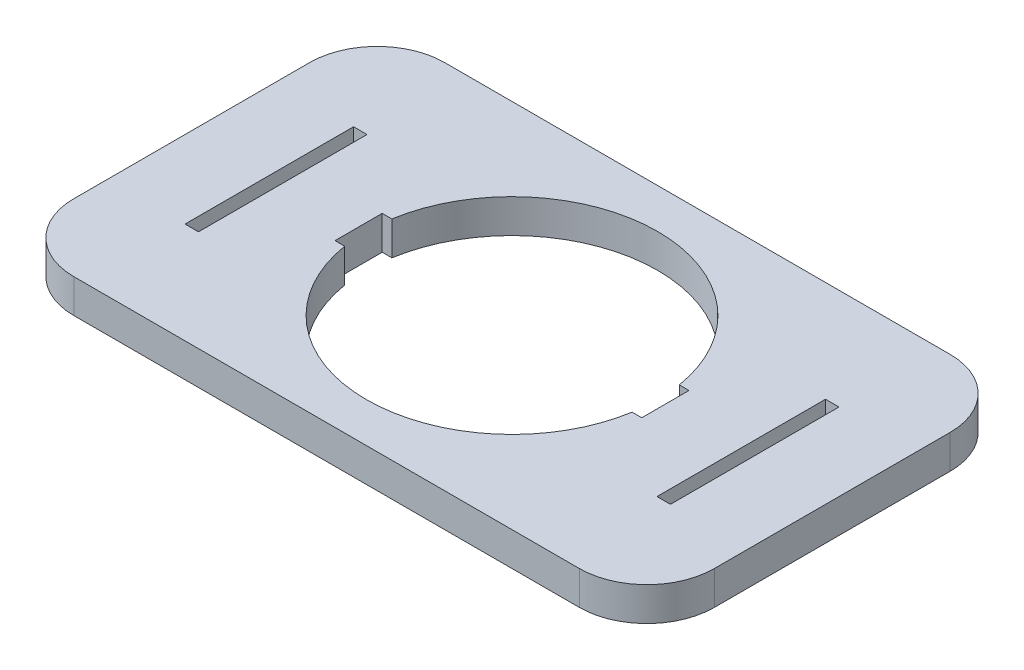
ISO-10303-21;
HEADER;
FILE_DESCRIPTION(('STEP AP214'),'2;1');
FILE_NAME('part.step','',(''),(''),'','','');
FILE_SCHEMA(('AUTOMOTIVE_DESIGN { 1 0 10303 214 1 1 1 1 }'));
ENDSEC;
DATA;
#1=APPLICATION_CONTEXT('core data for automotive mechanical design processes');
#2=APPLICATION_PROTOCOL_DEFINITION('international standard','automotive_design',2000,#1);
#3=PRODUCT_CONTEXT('',#1,'mechanical');
#4=PRODUCT('Part','Part','',(#3));
#5=PRODUCT_RELATED_PRODUCT_CATEGORY('part','',(#4));
#6=PRODUCT_DEFINITION_FORMATION('','',#4);
#7=PRODUCT_DEFINITION_CONTEXT('part definition',#1,'design');
#8=PRODUCT_DEFINITION('design','',#6,#7);
#9=PRODUCT_DEFINITION_SHAPE('','',#8);
#10=(LENGTH_UNIT() NAMED_UNIT(*) SI_UNIT(.MILLI.,.METRE.));
#11=(NAMED_UNIT(*) PLANE_ANGLE_UNIT() SI_UNIT($,.RADIAN.));
#12=(NAMED_UNIT(*) SI_UNIT($,.STERADIAN.) SOLID_ANGLE_UNIT());
#13=UNCERTAINTY_MEASURE_WITH_UNIT(LENGTH_MEASURE(1.E-05),#10,'distance_accuracy_value','');
#14=(GEOMETRIC_REPRESENTATION_CONTEXT(3) GLOBAL_UNCERTAINTY_ASSIGNED_CONTEXT((#13)) GLOBAL_UNIT_ASSIGNED_CONTEXT((#10,
#11,#12)) REPRESENTATION_CONTEXT('',''));
#15=CARTESIAN_POINT('',(0.,0.,0.));
#16=DIRECTION('',(0.,0.,1.));
#17=DIRECTION('',(1.,0.,0.));
#18=AXIS2_PLACEMENT_3D('',#15,#16,#17);
#19=CARTESIAN_POINT('',(47.5,-5.,0.));
#20=DIRECTION('',(-1.,0.,0.));
#21=DIRECTION('',(0.,0.,1.));
#22=AXIS2_PLACEMENT_3D('',#19,#20,#21);
#23=PLANE('',#22);
#24=DIRECTION('',(0.,0.,1.));
#25=VECTOR('',#24,1.);
#26=CARTESIAN_POINT('',(47.5,0.,0.));
#27=LINE('',#26,#25);
#28=CARTESIAN_POINT('',(47.5,0.,-17.5));
#29=VERTEX_POINT('',#28);
#30=CARTESIAN_POINT('',(47.5,0.,17.5));
#31=VERTEX_POINT('',#30);
#32=EDGE_CURVE('E335',#29,#31,#27,.T.);
#33=ORIENTED_EDGE('',*,*,#32,.T.);
#34=DIRECTION('',(0.,1.,0.));
#35=VECTOR('',#34,1.);
#36=CARTESIAN_POINT('',(47.5,-5.,17.5));
#37=LINE('',#36,#35);
#38=CARTESIAN_POINT('',(47.5,-5.,17.5));
#39=VERTEX_POINT('',#38);
#40=EDGE_CURVE('E10',#39,#31,#37,.T.);
#41=ORIENTED_EDGE('',*,*,#40,.F.);
#42=DIRECTION('',(0.,0.,1.));
#43=VECTOR('',#42,1.);
#44=CARTESIAN_POINT('',(47.5,-5.,0.));
#45=LINE('',#44,#43);
#46=CARTESIAN_POINT('',(47.5,-5.,-17.5));
#47=VERTEX_POINT('',#46);
#48=EDGE_CURVE('E585',#47,#39,#45,.T.);
#49=ORIENTED_EDGE('',*,*,#48,.F.);
#50=DIRECTION('',(0.,1.,0.));
#51=VECTOR('',#50,1.);
#52=CARTESIAN_POINT('',(47.5,-5.,-17.5));
#53=LINE('',#52,#51);
#54=EDGE_CURVE('E359',#47,#29,#53,.T.);
#55=ORIENTED_EDGE('',*,*,#54,.T.);
#56=EDGE_LOOP('',(#33,#41,#49,#55));
#57=FACE_BOUND('',#56,.T.);
#58=ADVANCED_FACE('F16',(#57),#23,.F.);
#59=CARTESIAN_POINT('',(37.5,-5.,17.5));
#60=DIRECTION('',(0.,1.,0.));
#61=DIRECTION('',(0.,0.,1.));
#62=AXIS2_PLACEMENT_3D('',#59,#60,#61);
#63=CYLINDRICAL_SURFACE('',#62,10.);
#64=CARTESIAN_POINT('',(37.5,0.,17.5));
#65=DIRECTION('',(0.,-1.,0.));
#66=DIRECTION('',(0.,0.,-1.));
#67=AXIS2_PLACEMENT_3D('',#64,#65,#66);
#68=CIRCLE('',#67,10.);
#69=CARTESIAN_POINT('',(37.5,0.,27.5));
#70=VERTEX_POINT('',#69);
#71=EDGE_CURVE('E339',#31,#70,#68,.T.);
#72=ORIENTED_EDGE('',*,*,#71,.T.);
#73=DIRECTION('',(0.,1.,0.));
#74=VECTOR('',#73,1.);
#75=CARTESIAN_POINT('',(37.5,-5.,27.5));
#76=LINE('',#75,#74);
#77=CARTESIAN_POINT('',(37.5,-5.,27.5));
#78=VERTEX_POINT('',#77);
#79=EDGE_CURVE('E27',#78,#70,#76,.T.);
#80=ORIENTED_EDGE('',*,*,#79,.F.);
#81=CARTESIAN_POINT('',(37.5,-5.,17.5));
#82=DIRECTION('',(0.,-1.,0.));
#83=DIRECTION('',(0.,0.,-1.));
#84=AXIS2_PLACEMENT_3D('',#81,#82,#83);
#85=CIRCLE('',#84,10.);
#86=EDGE_CURVE('E582',#39,#78,#85,.T.);
#87=ORIENTED_EDGE('',*,*,#86,.F.);
#88=ORIENTED_EDGE('',*,*,#40,.T.);
#89=EDGE_LOOP('',(#72,#80,#87,#88));
#90=FACE_BOUND('',#89,.T.);
#91=ADVANCED_FACE('F475',(#90),#63,.T.);
#92=CARTESIAN_POINT('',(0.,-5.,27.5));
#93=DIRECTION('',(0.,0.,-1.));
#94=DIRECTION('',(-1.,0.,0.));
#95=AXIS2_PLACEMENT_3D('',#92,#93,#94);
#96=PLANE('',#95);
#97=DIRECTION('',(-1.,0.,0.));
#98=VECTOR('',#97,1.);
#99=CARTESIAN_POINT('',(0.,0.,27.5));
#100=LINE('',#99,#98);
#101=CARTESIAN_POINT('',(-37.5,0.,27.5));
#102=VERTEX_POINT('',#101);
#103=EDGE_CURVE('E342',#70,#102,#100,.T.);
#104=ORIENTED_EDGE('',*,*,#103,.T.);
#105=DIRECTION('',(0.,1.,0.));
#106=VECTOR('',#105,1.);
#107=CARTESIAN_POINT('',(-37.5,-5.,27.5));
#108=LINE('',#107,#106);
#109=CARTESIAN_POINT('',(-37.5,-5.,27.5));
#110=VERTEX_POINT('',#109);
#111=EDGE_CURVE('E370',#110,#102,#108,.T.);
#112=ORIENTED_EDGE('',*,*,#111,.F.);
#113=DIRECTION('',(-1.,0.,0.));
#114=VECTOR('',#113,1.);
#115=CARTESIAN_POINT('',(0.,-5.,27.5));
#116=LINE('',#115,#114);
#117=EDGE_CURVE('E584',#78,#110,#116,.T.);
#118=ORIENTED_EDGE('',*,*,#117,.F.);
#119=ORIENTED_EDGE('',*,*,#79,.T.);
#120=EDGE_LOOP('',(#104,#112,#118,#119));
#121=FACE_BOUND('',#120,.T.);
#122=ADVANCED_FACE('F481',(#121),#96,.F.);
#123=CARTESIAN_POINT('',(-37.5,-5.,17.5));
#124=DIRECTION('',(0.,1.,0.));
#125=DIRECTION('',(0.,0.,1.));
#126=AXIS2_PLACEMENT_3D('',#123,#124,#125);
#127=CYLINDRICAL_SURFACE('',#126,10.);
#128=CARTESIAN_POINT('',(-37.5,0.,17.5));
#129=DIRECTION('',(0.,-1.,0.));
#130=DIRECTION('',(0.,0.,-1.));
#131=AXIS2_PLACEMENT_3D('',#128,#129,#130);
#132=CIRCLE('',#131,10.);
#133=CARTESIAN_POINT('',(-47.5,0.,17.5));
#134=VERTEX_POINT('',#133);
#135=EDGE_CURVE('E344',#102,#134,#132,.T.);
#136=ORIENTED_EDGE('',*,*,#135,.T.);
#137=DIRECTION('',(0.,1.,0.));
#138=VECTOR('',#137,1.);
#139=CARTESIAN_POINT('',(-47.5,-5.,17.5));
#140=LINE('',#139,#138);
#141=CARTESIAN_POINT('',(-47.5,-5.,17.5));
#142=VERTEX_POINT('',#141);
#143=EDGE_CURVE('E367',#142,#134,#140,.T.);
#144=ORIENTED_EDGE('',*,*,#143,.F.);
#145=CARTESIAN_POINT('',(-37.5,-5.,17.5));
#146=DIRECTION('',(0.,-1.,0.));
#147=DIRECTION('',(0.,0.,-1.));
#148=AXIS2_PLACEMENT_3D('',#145,#146,#147);
#149=CIRCLE('',#148,10.);
#150=EDGE_CURVE('E589',#110,#142,#149,.T.);
#151=ORIENTED_EDGE('',*,*,#150,.F.);
#152=ORIENTED_EDGE('',*,*,#111,.T.);
#153=EDGE_LOOP('',(#136,#144,#151,#152));
#154=FACE_BOUND('',#153,.T.);
#155=ADVANCED_FACE('F729',(#154),#127,.T.);
#156=CARTESIAN_POINT('',(-47.5,-5.,0.));
#157=DIRECTION('',(-1.,0.,0.));
#158=DIRECTION('',(0.,0.,1.));
#159=AXIS2_PLACEMENT_3D('',#156,#157,#158);
#160=PLANE('',#159);
#161=DIRECTION('',(0.,0.,1.));
#162=VECTOR('',#161,1.);
#163=CARTESIAN_POINT('',(-47.5,0.,0.));
#164=LINE('',#163,#162);
#165=CARTESIAN_POINT('',(-47.5,0.,-17.5));
#166=VERTEX_POINT('',#165);
#167=EDGE_CURVE('E348',#166,#134,#164,.T.);
#168=ORIENTED_EDGE('',*,*,#167,.F.);
#169=DIRECTION('',(0.,1.,0.));
#170=VECTOR('',#169,1.);
#171=CARTESIAN_POINT('',(-47.5,-5.,-17.5));
#172=LINE('',#171,#170);
#173=CARTESIAN_POINT('',(-47.5,-5.,-17.5));
#174=VERTEX_POINT('',#173);
#175=EDGE_CURVE('E259',#174,#166,#172,.T.);
#176=ORIENTED_EDGE('',*,*,#175,.F.);
#177=DIRECTION('',(0.,0.,1.));
#178=VECTOR('',#177,1.);
#179=CARTESIAN_POINT('',(-47.5,-5.,0.));
#180=LINE('',#179,#178);
#181=EDGE_CURVE('E246',#174,#142,#180,.T.);
#182=ORIENTED_EDGE('',*,*,#181,.T.);
#183=ORIENTED_EDGE('',*,*,#143,.T.);
#184=EDGE_LOOP('',(#168,#176,#182,#183));
#185=FACE_BOUND('',#184,.T.);
#186=ADVANCED_FACE('F732',(#185),#160,.T.);
#187=CARTESIAN_POINT('',(-37.5,-5.,-17.5));
#188=DIRECTION('',(0.,1.,0.));
#189=DIRECTION('',(0.,0.,1.));
#190=AXIS2_PLACEMENT_3D('',#187,#188,#189);
#191=CYLINDRICAL_SURFACE('',#190,10.);
#192=CARTESIAN_POINT('',(-37.5,0.,-17.5));
#193=DIRECTION('',(0.,-1.,0.));
#194=DIRECTION('',(0.,0.,-1.));
#195=AXIS2_PLACEMENT_3D('',#192,#193,#194);
#196=CIRCLE('',#195,10.);
#197=CARTESIAN_POINT('',(-37.5,0.,-27.5));
#198=VERTEX_POINT('',#197);
#199=EDGE_CURVE('E254',#166,#198,#196,.T.);
#200=ORIENTED_EDGE('',*,*,#199,.T.);
#201=DIRECTION('',(0.,1.,0.));
#202=VECTOR('',#201,1.);
#203=CARTESIAN_POINT('',(-37.5,-5.,-27.5));
#204=LINE('',#203,#202);
#205=CARTESIAN_POINT('',(-37.5,-5.,-27.5));
#206=VERTEX_POINT('',#205);
#207=EDGE_CURVE('E251',#206,#198,#204,.T.);
#208=ORIENTED_EDGE('',*,*,#207,.F.);
#209=CARTESIAN_POINT('',(-37.5,-5.,-17.5));
#210=DIRECTION('',(0.,-1.,0.));
#211=DIRECTION('',(0.,0.,-1.));
#212=AXIS2_PLACEMENT_3D('',#209,#210,#211);
#213=CIRCLE('',#212,10.);
#214=EDGE_CURVE('E240',#174,#206,#213,.T.);
#215=ORIENTED_EDGE('',*,*,#214,.F.);
#216=ORIENTED_EDGE('',*,*,#175,.T.);
#217=EDGE_LOOP('',(#200,#208,#215,#216));
#218=FACE_BOUND('',#217,.T.);
#219=ADVANCED_FACE('F252',(#218),#191,.T.);
#220=CARTESIAN_POINT('',(0.,-5.,-27.5));
#221=DIRECTION('',(0.,0.,-1.));
#222=DIRECTION('',(-1.,0.,0.));
#223=AXIS2_PLACEMENT_3D('',#220,#221,#222);
#224=PLANE('',#223);
#225=DIRECTION('',(-1.,0.,0.));
#226=VECTOR('',#225,1.);
#227=CARTESIAN_POINT('',(0.,0.,-27.5));
#228=LINE('',#227,#226);
#229=CARTESIAN_POINT('',(37.5,0.,-27.5));
#230=VERTEX_POINT('',#229);
#231=EDGE_CURVE('E354',#230,#198,#228,.T.);
#232=ORIENTED_EDGE('',*,*,#231,.F.);
#233=DIRECTION('',(0.,1.,0.));
#234=VECTOR('',#233,1.);
#235=CARTESIAN_POINT('',(37.5,-5.,-27.5));
#236=LINE('',#235,#234);
#237=CARTESIAN_POINT('',(37.5,-5.,-27.5));
#238=VERTEX_POINT('',#237);
#239=EDGE_CURVE('E142',#238,#230,#236,.T.);
#240=ORIENTED_EDGE('',*,*,#239,.F.);
#241=DIRECTION('',(-1.,0.,0.));
#242=VECTOR('',#241,1.);
#243=CARTESIAN_POINT('',(0.,-5.,-27.5));
#244=LINE('',#243,#242);
#245=EDGE_CURVE('E244',#238,#206,#244,.T.);
#246=ORIENTED_EDGE('',*,*,#245,.T.);
#247=ORIENTED_EDGE('',*,*,#207,.T.);
#248=EDGE_LOOP('',(#232,#240,#246,#247));
#249=FACE_BOUND('',#248,.T.);
#250=ADVANCED_FACE('F261',(#249),#224,.T.);
#251=CARTESIAN_POINT('',(36.,-5.,0.));
#252=DIRECTION('',(-1.,0.,0.));
#253=DIRECTION('',(0.,0.,1.));
#254=AXIS2_PLACEMENT_3D('',#251,#252,#253);
#255=PLANE('',#254);
#256=DIRECTION('',(0.,0.,1.));
#257=VECTOR('',#256,1.);
#258=CARTESIAN_POINT('',(36.,0.,0.));
#259=LINE('',#258,#257);
#260=CARTESIAN_POINT('',(36.,0.,-12.5));
#261=VERTEX_POINT('',#260);
#262=CARTESIAN_POINT('',(36.,0.,12.5));
#263=VERTEX_POINT('',#262);
#264=EDGE_CURVE('E319',#261,#263,#259,.T.);
#265=ORIENTED_EDGE('',*,*,#264,.F.);
#266=DIRECTION('',(0.,1.,0.));
#267=VECTOR('',#266,1.);
#268=CARTESIAN_POINT('',(36.,-5.,-12.5));
#269=LINE('',#268,#267);
#270=CARTESIAN_POINT('',(36.,-5.,-12.5));
#271=VERTEX_POINT('',#270);
#272=EDGE_CURVE('E362',#271,#261,#269,.T.);
#273=ORIENTED_EDGE('',*,*,#272,.F.);
#274=DIRECTION('',(0.,0.,1.));
#275=VECTOR('',#274,1.);
#276=CARTESIAN_POINT('',(36.,-5.,0.));
#277=LINE('',#276,#275);
#278=CARTESIAN_POINT('',(36.,-5.,12.5));
#279=VERTEX_POINT('',#278);
#280=EDGE_CURVE('E601',#271,#279,#277,.T.);
#281=ORIENTED_EDGE('',*,*,#280,.T.);
#282=DIRECTION('',(0.,1.,0.));
#283=VECTOR('',#282,1.);
#284=CARTESIAN_POINT('',(36.,-5.,12.5));
#285=LINE('',#284,#283);
#286=EDGE_CURVE('E377',#279,#263,#285,.T.);
#287=ORIENTED_EDGE('',*,*,#286,.T.);
#288=EDGE_LOOP('',(#265,#273,#281,#287));
#289=FACE_BOUND('',#288,.T.);
#290=ADVANCED_FACE('F499',(#289),#255,.T.);
#291=CARTESIAN_POINT('',(35.,-5.,-12.5));
#292=DIRECTION('',(0.,0.,-1.));
#293=DIRECTION('',(-1.,0.,0.));
#294=AXIS2_PLACEMENT_3D('',#291,#292,#293);
#295=PLANE('',#294);
#296=DIRECTION('',(-1.,0.,0.));
#297=VECTOR('',#296,1.);
#298=CARTESIAN_POINT('',(35.,0.,-12.5));
#299=LINE('',#298,#297);
#300=CARTESIAN_POINT('',(34.,0.,-12.5));
#301=VERTEX_POINT('',#300);
#302=EDGE_CURVE('E323',#261,#301,#299,.T.);
#303=ORIENTED_EDGE('',*,*,#302,.T.);
#304=DIRECTION('',(0.,1.,0.));
#305=VECTOR('',#304,1.);
#306=CARTESIAN_POINT('',(34.,-5.,-12.5));
#307=LINE('',#306,#305);
#308=CARTESIAN_POINT('',(34.,-5.,-12.5));
#309=VERTEX_POINT('',#308);
#310=EDGE_CURVE('E384',#309,#301,#307,.T.);
#311=ORIENTED_EDGE('',*,*,#310,.F.);
#312=DIRECTION('',(-1.,0.,0.));
#313=VECTOR('',#312,1.);
#314=CARTESIAN_POINT('',(35.,-5.,-12.5));
#315=LINE('',#314,#313);
#316=EDGE_CURVE('E597',#271,#309,#315,.T.);
#317=ORIENTED_EDGE('',*,*,#316,.F.);
#318=ORIENTED_EDGE('',*,*,#272,.T.);
#319=EDGE_LOOP('',(#303,#311,#317,#318));
#320=FACE_BOUND('',#319,.T.);
#321=ADVANCED_FACE('F495',(#320),#295,.F.);
#322=CARTESIAN_POINT('',(34.,-5.,0.));
#323=DIRECTION('',(-1.,0.,0.));
#324=DIRECTION('',(0.,0.,1.));
#325=AXIS2_PLACEMENT_3D('',#322,#323,#324);
#326=PLANE('',#325);
#327=DIRECTION('',(0.,0.,1.));
#328=VECTOR('',#327,1.);
#329=CARTESIAN_POINT('',(34.,0.,0.));
#330=LINE('',#329,#328);
#331=CARTESIAN_POINT('',(34.,0.,12.5));
#332=VERTEX_POINT('',#331);
#333=EDGE_CURVE('E327',#301,#332,#330,.T.);
#334=ORIENTED_EDGE('',*,*,#333,.T.);
#335=DIRECTION('',(0.,1.,0.));
#336=VECTOR('',#335,1.);
#337=CARTESIAN_POINT('',(34.,-5.,12.5));
#338=LINE('',#337,#336);
#339=CARTESIAN_POINT('',(34.,-5.,12.5));
#340=VERTEX_POINT('',#339);
#341=EDGE_CURVE('E380',#340,#332,#338,.T.);
#342=ORIENTED_EDGE('',*,*,#341,.F.);
#343=DIRECTION('',(0.,0.,1.));
#344=VECTOR('',#343,1.);
#345=CARTESIAN_POINT('',(34.,-5.,0.));
#346=LINE('',#345,#344);
#347=EDGE_CURVE('E594',#309,#340,#346,.T.);
#348=ORIENTED_EDGE('',*,*,#347,.F.);
#349=ORIENTED_EDGE('',*,*,#310,.T.);
#350=EDGE_LOOP('',(#334,#342,#348,#349));
#351=FACE_BOUND('',#350,.T.);
#352=ADVANCED_FACE('F491',(#351),#326,.F.);
#353=CARTESIAN_POINT('',(-34.,-5.,0.));
#354=DIRECTION('',(-1.,0.,0.));
#355=DIRECTION('',(0.,0.,1.));
#356=AXIS2_PLACEMENT_3D('',#353,#354,#355);
#357=PLANE('',#356);
#358=DIRECTION('',(0.,0.,1.));
#359=VECTOR('',#358,1.);
#360=CARTESIAN_POINT('',(-34.,0.,0.));
#361=LINE('',#360,#359);
#362=CARTESIAN_POINT('',(-34.,0.,-12.5));
#363=VERTEX_POINT('',#362);
#364=CARTESIAN_POINT('',(-34.,0.,12.5));
#365=VERTEX_POINT('',#364);
#366=EDGE_CURVE('E303',#363,#365,#361,.T.);
#367=ORIENTED_EDGE('',*,*,#366,.F.);
#368=DIRECTION('',(0.,1.,0.));
#369=VECTOR('',#368,1.);
#370=CARTESIAN_POINT('',(-34.,-5.,-12.5));
#371=LINE('',#370,#369);
#372=CARTESIAN_POINT('',(-34.,-5.,-12.5));
#373=VERTEX_POINT('',#372);
#374=EDGE_CURVE('E381',#373,#363,#371,.T.);
#375=ORIENTED_EDGE('',*,*,#374,.F.);
#376=DIRECTION('',(0.,0.,1.));
#377=VECTOR('',#376,1.);
#378=CARTESIAN_POINT('',(-34.,-5.,0.));
#379=LINE('',#378,#377);
#380=CARTESIAN_POINT('',(-34.,-5.,12.5));
#381=VERTEX_POINT('',#380);
#382=EDGE_CURVE('E624',#373,#381,#379,.T.);
#383=ORIENTED_EDGE('',*,*,#382,.T.);
#384=DIRECTION('',(0.,1.,0.));
#385=VECTOR('',#384,1.);
#386=CARTESIAN_POINT('',(-34.,-5.,12.5));
#387=LINE('',#386,#385);
#388=EDGE_CURVE('E390',#381,#365,#387,.T.);
#389=ORIENTED_EDGE('',*,*,#388,.T.);
#390=EDGE_LOOP('',(#367,#375,#383,#389));
#391=FACE_BOUND('',#390,.T.);
#392=ADVANCED_FACE('F494',(#391),#357,.T.);
#393=CARTESIAN_POINT('',(-35.,-5.,-12.5));
#394=DIRECTION('',(0.,0.,-1.));
#395=DIRECTION('',(-1.,0.,0.));
#396=AXIS2_PLACEMENT_3D('',#393,#394,#395);
#397=PLANE('',#396);
#398=DIRECTION('',(-1.,0.,0.));
#399=VECTOR('',#398,1.);
#400=CARTESIAN_POINT('',(-35.,0.,-12.5));
#401=LINE('',#400,#399);
#402=CARTESIAN_POINT('',(-36.,0.,-12.5));
#403=VERTEX_POINT('',#402);
#404=EDGE_CURVE('E307',#363,#403,#401,.T.);
#405=ORIENTED_EDGE('',*,*,#404,.T.);
#406=DIRECTION('',(0.,1.,0.));
#407=VECTOR('',#406,1.);
#408=CARTESIAN_POINT('',(-36.,-5.,-12.5));
#409=LINE('',#408,#407);
#410=CARTESIAN_POINT('',(-36.,-5.,-12.5));
#411=VERTEX_POINT('',#410);
#412=EDGE_CURVE('E396',#411,#403,#409,.T.);
#413=ORIENTED_EDGE('',*,*,#412,.F.);
#414=DIRECTION('',(-1.,0.,0.));
#415=VECTOR('',#414,1.);
#416=CARTESIAN_POINT('',(-35.,-5.,-12.5));
#417=LINE('',#416,#415);
#418=EDGE_CURVE('E620',#373,#411,#417,.T.);
#419=ORIENTED_EDGE('',*,*,#418,.F.);
#420=ORIENTED_EDGE('',*,*,#374,.T.);
#421=EDGE_LOOP('',(#405,#413,#419,#420));
#422=FACE_BOUND('',#421,.T.);
#423=ADVANCED_FACE('F510',(#422),#397,.F.);
#424=CARTESIAN_POINT('',(-36.,-5.,0.));
#425=DIRECTION('',(-1.,0.,0.));
#426=DIRECTION('',(0.,0.,1.));
#427=AXIS2_PLACEMENT_3D('',#424,#425,#426);
#428=PLANE('',#427);
#429=DIRECTION('',(0.,0.,1.));
#430=VECTOR('',#429,1.);
#431=CARTESIAN_POINT('',(-36.,0.,0.));
#432=LINE('',#431,#430);
#433=CARTESIAN_POINT('',(-36.,0.,12.5));
#434=VERTEX_POINT('',#433);
#435=EDGE_CURVE('E311',#403,#434,#432,.T.);
#436=ORIENTED_EDGE('',*,*,#435,.T.);
#437=DIRECTION('',(0.,1.,0.));
#438=VECTOR('',#437,1.);
#439=CARTESIAN_POINT('',(-36.,-5.,12.5));
#440=LINE('',#439,#438);
#441=CARTESIAN_POINT('',(-36.,-5.,12.5));
#442=VERTEX_POINT('',#441);
#443=EDGE_CURVE('E393',#442,#434,#440,.T.);
#444=ORIENTED_EDGE('',*,*,#443,.F.);
#445=DIRECTION('',(0.,0.,1.));
#446=VECTOR('',#445,1.);
#447=CARTESIAN_POINT('',(-36.,-5.,0.));
#448=LINE('',#447,#446);
#449=EDGE_CURVE('E618',#411,#442,#448,.T.);
#450=ORIENTED_EDGE('',*,*,#449,.F.);
#451=ORIENTED_EDGE('',*,*,#412,.T.);
#452=EDGE_LOOP('',(#436,#444,#450,#451));
#453=FACE_BOUND('',#452,.T.);
#454=ADVANCED_FACE('F507',(#453),#428,.F.);
#455=CARTESIAN_POINT('',(0.,-5.,0.));
#456=DIRECTION('',(0.,1.,0.));
#457=DIRECTION('',(0.,0.,1.));
#458=AXIS2_PLACEMENT_3D('',#455,#456,#457);
#459=CYLINDRICAL_SURFACE('',#458,21.6);
#460=CARTESIAN_POINT('',(0.,0.,0.));
#461=DIRECTION('',(0.,-1.,0.));
#462=DIRECTION('',(0.,0.,-1.));
#463=AXIS2_PLACEMENT_3D('',#460,#461,#462);
#464=CIRCLE('',#463,21.6);
#465=CARTESIAN_POINT('',(-21.3145490217363,0.,-3.5));
#466=VERTEX_POINT('',#465);
#467=CARTESIAN_POINT('',(21.3145490217363,0.,-3.5));
#468=VERTEX_POINT('',#467);
#469=EDGE_CURVE('E272',#466,#468,#464,.T.);
#470=ORIENTED_EDGE('',*,*,#469,.F.);
#471=DIRECTION('',(0.,1.,0.));
#472=VECTOR('',#471,1.);
#473=CARTESIAN_POINT('',(-21.3145490217363,-5.,-3.5));
#474=LINE('',#473,#472);
#475=CARTESIAN_POINT('',(-21.3145490217363,-5.,-3.5));
#476=VERTEX_POINT('',#475);
#477=EDGE_CURVE('E20',#476,#466,#474,.T.);
#478=ORIENTED_EDGE('',*,*,#477,.F.);
#479=CARTESIAN_POINT('',(0.,-5.,0.));
#480=DIRECTION('',(0.,-1.,0.));
#481=DIRECTION('',(0.,0.,-1.));
#482=AXIS2_PLACEMENT_3D('',#479,#480,#481);
#483=CIRCLE('',#482,21.6);
#484=CARTESIAN_POINT('',(21.3145490217363,-5.,-3.5));
#485=VERTEX_POINT('',#484);
#486=EDGE_CURVE('E358',#476,#485,#483,.T.);
#487=ORIENTED_EDGE('',*,*,#486,.T.);
#488=DIRECTION('',(0.,1.,0.));
#489=VECTOR('',#488,1.);
#490=CARTESIAN_POINT('',(21.3145490217363,-5.,-3.5));
#491=LINE('',#490,#489);
#492=EDGE_CURVE('E268',#485,#468,#491,.T.);
#493=ORIENTED_EDGE('',*,*,#492,.T.);
#494=EDGE_LOOP('',(#470,#478,#487,#493));
#495=FACE_BOUND('',#494,.T.);
#496=ADVANCED_FACE('F18',(#495),#459,.F.);
#497=CARTESIAN_POINT('',(-22.0322745108682,-5.,-3.5));
#498=DIRECTION('',(0.,0.,-1.));
#499=DIRECTION('',(-1.,0.,0.));
#500=AXIS2_PLACEMENT_3D('',#497,#498,#499);
#501=PLANE('',#500);
#502=DIRECTION('',(-1.,0.,0.));
#503=VECTOR('',#502,1.);
#504=CARTESIAN_POINT('',(-22.0322745108682,0.,-3.5));
#505=LINE('',#504,#503);
#506=CARTESIAN_POINT('',(-22.75,0.,-3.5));
#507=VERTEX_POINT('',#506);
#508=EDGE_CURVE('E276',#466,#507,#505,.T.);
#509=ORIENTED_EDGE('',*,*,#508,.T.);
#510=DIRECTION('',(0.,1.,0.));
#511=VECTOR('',#510,1.);
#512=CARTESIAN_POINT('',(-22.75,-5.,-3.5));
#513=LINE('',#512,#511);
#514=CARTESIAN_POINT('',(-22.75,-5.,-3.5));
#515=VERTEX_POINT('',#514);
#516=EDGE_CURVE('E418',#515,#507,#513,.T.);
#517=ORIENTED_EDGE('',*,*,#516,.F.);
#518=DIRECTION('',(-1.,0.,0.));
#519=VECTOR('',#518,1.);
#520=CARTESIAN_POINT('',(-22.0322745108682,-5.,-3.5));
#521=LINE('',#520,#519);
#522=EDGE_CURVE('E431',#476,#515,#521,.T.);
#523=ORIENTED_EDGE('',*,*,#522,.F.);
#524=ORIENTED_EDGE('',*,*,#477,.T.);
#525=EDGE_LOOP('',(#509,#517,#523,#524));
#526=FACE_BOUND('',#525,.T.);
#527=ADVANCED_FACE('F430',(#526),#501,.F.);
#528=CARTESIAN_POINT('',(-22.75,-5.,0.));
#529=DIRECTION('',(-1.,0.,0.));
#530=DIRECTION('',(0.,0.,1.));
#531=AXIS2_PLACEMENT_3D('',#528,#529,#530);
#532=PLANE('',#531);
#533=DIRECTION('',(0.,0.,1.));
#534=VECTOR('',#533,1.);
#535=CARTESIAN_POINT('',(-22.75,0.,0.));
#536=LINE('',#535,#534);
#537=CARTESIAN_POINT('',(-22.75,0.,3.5));
#538=VERTEX_POINT('',#537);
#539=EDGE_CURVE('E279',#507,#538,#536,.T.);
#540=ORIENTED_EDGE('',*,*,#539,.T.);
#541=DIRECTION('',(0.,1.,0.));
#542=VECTOR('',#541,1.);
#543=CARTESIAN_POINT('',(-22.75,-5.,3.5));
#544=LINE('',#543,#542);
#545=CARTESIAN_POINT('',(-22.75,-5.,3.5));
#546=VERTEX_POINT('',#545);
#547=EDGE_CURVE('E416',#546,#538,#544,.T.);
#548=ORIENTED_EDGE('',*,*,#547,.F.);
#549=DIRECTION('',(0.,0.,1.));
#550=VECTOR('',#549,1.);
#551=CARTESIAN_POINT('',(-22.75,-5.,0.));
#552=LINE('',#551,#550);
#553=EDGE_CURVE('E665',#515,#546,#552,.T.);
#554=ORIENTED_EDGE('',*,*,#553,.F.);
#555=ORIENTED_EDGE('',*,*,#516,.T.);
#556=EDGE_LOOP('',(#540,#548,#554,#555));
#557=FACE_BOUND('',#556,.T.);
#558=ADVANCED_FACE('F465',(#557),#532,.F.);
#559=CARTESIAN_POINT('',(-22.0322745108682,-5.,3.5));
#560=DIRECTION('',(0.,0.,-1.));
#561=DIRECTION('',(-1.,0.,0.));
#562=AXIS2_PLACEMENT_3D('',#559,#560,#561);
#563=PLANE('',#562);
#564=DIRECTION('',(-1.,0.,0.));
#565=VECTOR('',#564,1.);
#566=CARTESIAN_POINT('',(-22.0322745108682,0.,3.5));
#567=LINE('',#566,#565);
#568=CARTESIAN_POINT('',(-21.3145490217363,0.,3.5));
#569=VERTEX_POINT('',#568);
#570=EDGE_CURVE('E283',#569,#538,#567,.T.);
#571=ORIENTED_EDGE('',*,*,#570,.F.);
#572=DIRECTION('',(0.,1.,0.));
#573=VECTOR('',#572,1.);
#574=CARTESIAN_POINT('',(-21.3145490217363,-5.,3.5));
#575=LINE('',#574,#573);
#576=CARTESIAN_POINT('',(-21.3145490217363,-5.,3.5));
#577=VERTEX_POINT('',#576);
#578=EDGE_CURVE('E413',#577,#569,#575,.T.);
#579=ORIENTED_EDGE('',*,*,#578,.F.);
#580=DIRECTION('',(-1.,0.,0.));
#581=VECTOR('',#580,1.);
#582=CARTESIAN_POINT('',(-22.0322745108682,-5.,3.5));
#583=LINE('',#582,#581);
#584=EDGE_CURVE('E464',#577,#546,#583,.T.);
#585=ORIENTED_EDGE('',*,*,#584,.T.);
#586=ORIENTED_EDGE('',*,*,#547,.T.);
#587=EDGE_LOOP('',(#571,#579,#585,#586));
#588=FACE_BOUND('',#587,.T.);
#589=ADVANCED_FACE('F462',(#588),#563,.T.);
#590=CARTESIAN_POINT('',(0.,-5.,0.));
#591=DIRECTION('',(0.,1.,0.));
#592=DIRECTION('',(0.,0.,1.));
#593=AXIS2_PLACEMENT_3D('',#590,#591,#592);
#594=CYLINDRICAL_SURFACE('',#593,21.6);
#595=CARTESIAN_POINT('',(0.,0.,0.));
#596=DIRECTION('',(0.,-1.,0.));
#597=DIRECTION('',(0.,0.,-1.));
#598=AXIS2_PLACEMENT_3D('',#595,#596,#597);
#599=CIRCLE('',#598,21.6);
#600=CARTESIAN_POINT('',(21.3145490217363,0.,3.5));
#601=VERTEX_POINT('',#600);
#602=EDGE_CURVE('E287',#601,#569,#599,.T.);
#603=ORIENTED_EDGE('',*,*,#602,.F.);
#604=DIRECTION('',(0.,1.,0.));
#605=VECTOR('',#604,1.);
#606=CARTESIAN_POINT('',(21.3145490217363,-5.,3.5));
#607=LINE('',#606,#605);
#608=CARTESIAN_POINT('',(21.3145490217363,-5.,3.5));
#609=VERTEX_POINT('',#608);
#610=EDGE_CURVE('E410',#609,#601,#607,.T.);
#611=ORIENTED_EDGE('',*,*,#610,.F.);
#612=CARTESIAN_POINT('',(0.,-5.,0.));
#613=DIRECTION('',(0.,-1.,0.));
#614=DIRECTION('',(0.,0.,-1.));
#615=AXIS2_PLACEMENT_3D('',#612,#613,#614);
#616=CIRCLE('',#615,21.6);
#617=EDGE_CURVE('E458',#609,#577,#616,.T.);
#618=ORIENTED_EDGE('',*,*,#617,.T.);
#619=ORIENTED_EDGE('',*,*,#578,.T.);
#620=EDGE_LOOP('',(#603,#611,#618,#619));
#621=FACE_BOUND('',#620,.T.);
#622=ADVANCED_FACE('F455',(#621),#594,.F.);
#623=CARTESIAN_POINT('',(22.0322745108682,-5.,3.5));
#624=DIRECTION('',(0.,0.,-1.));
#625=DIRECTION('',(-1.,0.,0.));
#626=AXIS2_PLACEMENT_3D('',#623,#624,#625);
#627=PLANE('',#626);
#628=DIRECTION('',(-1.,0.,0.));
#629=VECTOR('',#628,1.);
#630=CARTESIAN_POINT('',(22.0322745108682,0.,3.5));
#631=LINE('',#630,#629);
#632=CARTESIAN_POINT('',(22.75,0.,3.5));
#633=VERTEX_POINT('',#632);
#634=EDGE_CURVE('E291',#633,#601,#631,.T.);
#635=ORIENTED_EDGE('',*,*,#634,.F.);
#636=DIRECTION('',(0.,1.,0.));
#637=VECTOR('',#636,1.);
#638=CARTESIAN_POINT('',(22.75,-5.,3.5));
#639=LINE('',#638,#637);
#640=CARTESIAN_POINT('',(22.75,-5.,3.5));
#641=VERTEX_POINT('',#640);
#642=EDGE_CURVE('E407',#641,#633,#639,.T.);
#643=ORIENTED_EDGE('',*,*,#642,.F.);
#644=DIRECTION('',(-1.,0.,0.));
#645=VECTOR('',#644,1.);
#646=CARTESIAN_POINT('',(22.0322745108682,-5.,3.5));
#647=LINE('',#646,#645);
#648=EDGE_CURVE('E658',#641,#609,#647,.T.);
#649=ORIENTED_EDGE('',*,*,#648,.T.);
#650=ORIENTED_EDGE('',*,*,#610,.T.);
#651=EDGE_LOOP('',(#635,#643,#649,#650));
#652=FACE_BOUND('',#651,.T.);
#653=ADVANCED_FACE('F451',(#652),#627,.T.);
#654=CARTESIAN_POINT('',(22.75,-5.,0.));
#655=DIRECTION('',(-1.,0.,0.));
#656=DIRECTION('',(0.,0.,1.));
#657=AXIS2_PLACEMENT_3D('',#654,#655,#656);
#658=PLANE('',#657);
#659=DIRECTION('',(0.,0.,1.));
#660=VECTOR('',#659,1.);
#661=CARTESIAN_POINT('',(22.75,0.,0.));
#662=LINE('',#661,#660);
#663=CARTESIAN_POINT('',(22.75,0.,-3.5));
#664=VERTEX_POINT('',#663);
#665=EDGE_CURVE('E295',#664,#633,#662,.T.);
#666=ORIENTED_EDGE('',*,*,#665,.F.);
#667=DIRECTION('',(0.,1.,0.));
#668=VECTOR('',#667,1.);
#669=CARTESIAN_POINT('',(22.75,-5.,-3.5));
#670=LINE('',#669,#668);
#671=CARTESIAN_POINT('',(22.75,-5.,-3.5));
#672=VERTEX_POINT('',#671);
#673=EDGE_CURVE('E404',#672,#664,#670,.T.);
#674=ORIENTED_EDGE('',*,*,#673,.F.);
#675=DIRECTION('',(0.,0.,1.));
#676=VECTOR('',#675,1.);
#677=CARTESIAN_POINT('',(22.75,-5.,0.));
#678=LINE('',#677,#676);
#679=EDGE_CURVE('E447',#672,#641,#678,.T.);
#680=ORIENTED_EDGE('',*,*,#679,.T.);
#681=ORIENTED_EDGE('',*,*,#642,.T.);
#682=EDGE_LOOP('',(#666,#674,#680,#681));
#683=FACE_BOUND('',#682,.T.);
#684=ADVANCED_FACE('F443',(#683),#658,.T.);
#685=CARTESIAN_POINT('',(35.,-5.,12.5));
#686=DIRECTION('',(0.,0.,-1.));
#687=DIRECTION('',(-1.,0.,0.));
#688=AXIS2_PLACEMENT_3D('',#685,#686,#687);
#689=PLANE('',#688);
#690=DIRECTION('',(-1.,0.,0.));
#691=VECTOR('',#690,1.);
#692=CARTESIAN_POINT('',(35.,0.,12.5));
#693=LINE('',#692,#691);
#694=EDGE_CURVE('E331',#263,#332,#693,.T.);
#695=ORIENTED_EDGE('',*,*,#694,.F.);
#696=ORIENTED_EDGE('',*,*,#286,.F.);
#697=DIRECTION('',(-1.,0.,0.));
#698=VECTOR('',#697,1.);
#699=CARTESIAN_POINT('',(35.,-5.,12.5));
#700=LINE('',#699,#698);
#701=EDGE_CURVE('E596',#279,#340,#700,.T.);
#702=ORIENTED_EDGE('',*,*,#701,.T.);
#703=ORIENTED_EDGE('',*,*,#341,.T.);
#704=EDGE_LOOP('',(#695,#696,#702,#703));
#705=FACE_BOUND('',#704,.T.);
#706=ADVANCED_FACE('F486',(#705),#689,.T.);
#707=CARTESIAN_POINT('',(-35.,-5.,12.5));
#708=DIRECTION('',(0.,0.,-1.));
#709=DIRECTION('',(-1.,0.,0.));
#710=AXIS2_PLACEMENT_3D('',#707,#708,#709);
#711=PLANE('',#710);
#712=DIRECTION('',(-1.,0.,0.));
#713=VECTOR('',#712,1.);
#714=CARTESIAN_POINT('',(-35.,0.,12.5));
#715=LINE('',#714,#713);
#716=EDGE_CURVE('E315',#365,#434,#715,.T.);
#717=ORIENTED_EDGE('',*,*,#716,.F.);
#718=ORIENTED_EDGE('',*,*,#388,.F.);
#719=DIRECTION('',(-1.,0.,0.));
#720=VECTOR('',#719,1.);
#721=CARTESIAN_POINT('',(-35.,-5.,12.5));
#722=LINE('',#721,#720);
#723=EDGE_CURVE('E604',#381,#442,#722,.T.);
#724=ORIENTED_EDGE('',*,*,#723,.T.);
#725=ORIENTED_EDGE('',*,*,#443,.T.);
#726=EDGE_LOOP('',(#717,#718,#724,#725));
#727=FACE_BOUND('',#726,.T.);
#728=ADVANCED_FACE('F489',(#727),#711,.T.);
#729=CARTESIAN_POINT('',(22.0322745108682,-5.,-3.5));
#730=DIRECTION('',(0.,0.,-1.));
#731=DIRECTION('',(-1.,0.,0.));
#732=AXIS2_PLACEMENT_3D('',#729,#730,#731);
#733=PLANE('',#732);
#734=DIRECTION('',(-1.,0.,0.));
#735=VECTOR('',#734,1.);
#736=CARTESIAN_POINT('',(22.0322745108682,0.,-3.5));
#737=LINE('',#736,#735);
#738=EDGE_CURVE('E299',#664,#468,#737,.T.);
#739=ORIENTED_EDGE('',*,*,#738,.T.);
#740=ORIENTED_EDGE('',*,*,#492,.F.);
#741=DIRECTION('',(-1.,0.,0.));
#742=VECTOR('',#741,1.);
#743=CARTESIAN_POINT('',(22.0322745108682,-5.,-3.5));
#744=LINE('',#743,#742);
#745=EDGE_CURVE('E627',#672,#485,#744,.T.);
#746=ORIENTED_EDGE('',*,*,#745,.F.);
#747=ORIENTED_EDGE('',*,*,#673,.T.);
#748=EDGE_LOOP('',(#739,#740,#746,#747));
#749=FACE_BOUND('',#748,.T.);
#750=ADVANCED_FACE('F440',(#749),#733,.F.);
#751=CARTESIAN_POINT('',(37.5,-5.,-17.5));
#752=DIRECTION('',(0.,1.,0.));
#753=DIRECTION('',(0.,0.,1.));
#754=AXIS2_PLACEMENT_3D('',#751,#752,#753);
#755=CYLINDRICAL_SURFACE('',#754,10.);
#756=CARTESIAN_POINT('',(37.5,0.,-17.5));
#757=DIRECTION('',(0.,-1.,0.));
#758=DIRECTION('',(0.,0.,-1.));
#759=AXIS2_PLACEMENT_3D('',#756,#757,#758);
#760=CIRCLE('',#759,10.);
#761=EDGE_CURVE('E147',#230,#29,#760,.T.);
#762=ORIENTED_EDGE('',*,*,#761,.T.);
#763=ORIENTED_EDGE('',*,*,#54,.F.);
#764=CARTESIAN_POINT('',(37.5,-5.,-17.5));
#765=DIRECTION('',(0.,-1.,0.));
#766=DIRECTION('',(0.,0.,-1.));
#767=AXIS2_PLACEMENT_3D('',#764,#765,#766);
#768=CIRCLE('',#767,10.);
#769=EDGE_CURVE('E41',#238,#47,#768,.T.);
#770=ORIENTED_EDGE('',*,*,#769,.F.);
#771=ORIENTED_EDGE('',*,*,#239,.T.);
#772=EDGE_LOOP('',(#762,#763,#770,#771));
#773=FACE_BOUND('',#772,.T.);
#774=ADVANCED_FACE('F520',(#773),#755,.T.);
#775=CARTESIAN_POINT('',(0.,-5.,0.));
#776=DIRECTION('',(0.,-1.,0.));
#777=DIRECTION('',(1.,0.,0.));
#778=AXIS2_PLACEMENT_3D('',#775,#776,#777);
#779=PLANE('',#778);
#780=ORIENTED_EDGE('',*,*,#486,.F.);
#781=ORIENTED_EDGE('',*,*,#522,.T.);
#782=ORIENTED_EDGE('',*,*,#553,.T.);
#783=ORIENTED_EDGE('',*,*,#584,.F.);
#784=ORIENTED_EDGE('',*,*,#617,.F.);
#785=ORIENTED_EDGE('',*,*,#648,.F.);
#786=ORIENTED_EDGE('',*,*,#679,.F.);
#787=ORIENTED_EDGE('',*,*,#745,.T.);
#788=EDGE_LOOP('',(#780,#781,#782,#783,#784,#785,#786,#787));
#789=FACE_BOUND('',#788,.T.);
#790=ORIENTED_EDGE('',*,*,#382,.F.);
#791=ORIENTED_EDGE('',*,*,#418,.T.);
#792=ORIENTED_EDGE('',*,*,#449,.T.);
#793=ORIENTED_EDGE('',*,*,#723,.F.);
#794=EDGE_LOOP('',(#790,#791,#792,#793));
#795=FACE_BOUND('',#794,.T.);
#796=ORIENTED_EDGE('',*,*,#280,.F.);
#797=ORIENTED_EDGE('',*,*,#316,.T.);
#798=ORIENTED_EDGE('',*,*,#347,.T.);
#799=ORIENTED_EDGE('',*,*,#701,.F.);
#800=EDGE_LOOP('',(#796,#797,#798,#799));
#801=FACE_BOUND('',#800,.T.);
#802=ORIENTED_EDGE('',*,*,#48,.T.);
#803=ORIENTED_EDGE('',*,*,#86,.T.);
#804=ORIENTED_EDGE('',*,*,#117,.T.);
#805=ORIENTED_EDGE('',*,*,#150,.T.);
#806=ORIENTED_EDGE('',*,*,#181,.F.);
#807=ORIENTED_EDGE('',*,*,#214,.T.);
#808=ORIENTED_EDGE('',*,*,#245,.F.);
#809=ORIENTED_EDGE('',*,*,#769,.T.);
#810=EDGE_LOOP('',(#802,#803,#804,#805,#806,#807,#808,#809));
#811=FACE_BOUND('',#810,.T.);
#812=ADVANCED_FACE('F242',(#789,#795,#801,#811),#779,.T.);
#813=CARTESIAN_POINT('',(0.,0.,0.));
#814=DIRECTION('',(0.,-1.,0.));
#815=DIRECTION('',(1.,0.,0.));
#816=AXIS2_PLACEMENT_3D('',#813,#814,#815);
#817=PLANE('',#816);
#818=ORIENTED_EDGE('',*,*,#469,.T.);
#819=ORIENTED_EDGE('',*,*,#738,.F.);
#820=ORIENTED_EDGE('',*,*,#665,.T.);
#821=ORIENTED_EDGE('',*,*,#634,.T.);
#822=ORIENTED_EDGE('',*,*,#602,.T.);
#823=ORIENTED_EDGE('',*,*,#570,.T.);
#824=ORIENTED_EDGE('',*,*,#539,.F.);
#825=ORIENTED_EDGE('',*,*,#508,.F.);
#826=EDGE_LOOP('',(#818,#819,#820,#821,#822,#823,#824,#825));
#827=FACE_BOUND('',#826,.T.);
#828=ORIENTED_EDGE('',*,*,#366,.T.);
#829=ORIENTED_EDGE('',*,*,#716,.T.);
#830=ORIENTED_EDGE('',*,*,#435,.F.);
#831=ORIENTED_EDGE('',*,*,#404,.F.);
#832=EDGE_LOOP('',(#828,#829,#830,#831));
#833=FACE_BOUND('',#832,.T.);
#834=ORIENTED_EDGE('',*,*,#264,.T.);
#835=ORIENTED_EDGE('',*,*,#694,.T.);
#836=ORIENTED_EDGE('',*,*,#333,.F.);
#837=ORIENTED_EDGE('',*,*,#302,.F.);
#838=EDGE_LOOP('',(#834,#835,#836,#837));
#839=FACE_BOUND('',#838,.T.);
#840=ORIENTED_EDGE('',*,*,#32,.F.);
#841=ORIENTED_EDGE('',*,*,#761,.F.);
#842=ORIENTED_EDGE('',*,*,#231,.T.);
#843=ORIENTED_EDGE('',*,*,#199,.F.);
#844=ORIENTED_EDGE('',*,*,#167,.T.);
#845=ORIENTED_EDGE('',*,*,#135,.F.);
#846=ORIENTED_EDGE('',*,*,#103,.F.);
#847=ORIENTED_EDGE('',*,*,#71,.F.);
#848=EDGE_LOOP('',(#840,#841,#842,#843,#844,#845,#846,#847));
#849=FACE_BOUND('',#848,.T.);
#850=ADVANCED_FACE('F434',(#827,#833,#839,#849),#817,.F.);
#851=CLOSED_SHELL('',(#58,#91,#122,#155,#186,#219,#250,#290,#321,#352,#392,#423,#454,#496,#527,
#558,#589,#622,#653,#684,#706,#728,#750,#774,#812,#850));
#852=MANIFOLD_SOLID_BREP('B1',#851);
#853=ADVANCED_BREP_SHAPE_REPRESENTATION('',(#18,#852),#14);
#854=SHAPE_DEFINITION_REPRESENTATION(#9,#853);
ENDSEC;
END-ISO-10303-21;
